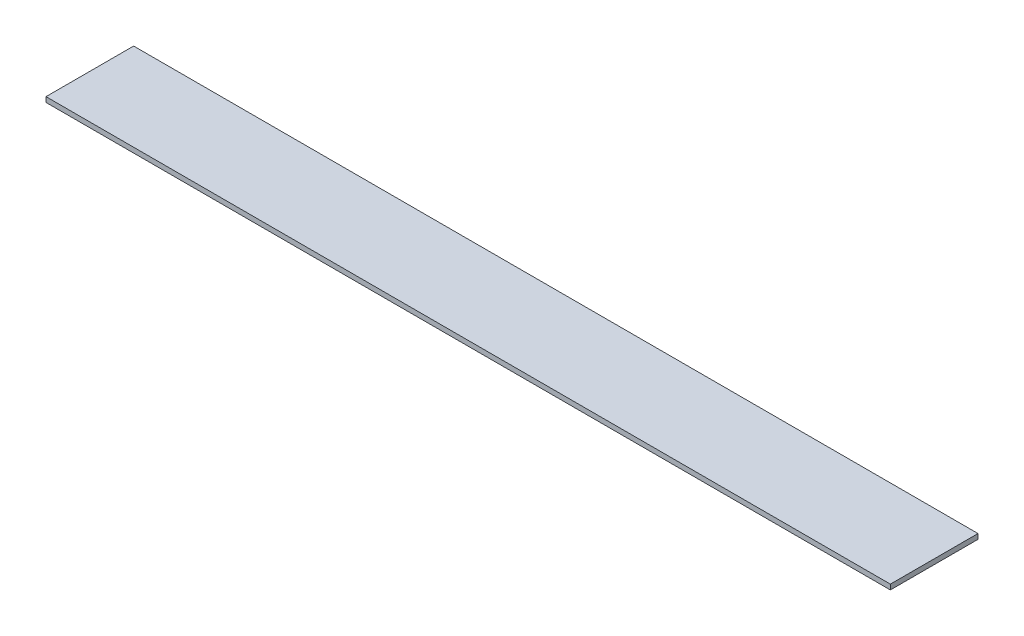
ISO-10303-21;
HEADER;
FILE_DESCRIPTION(('STEP AP214'),'2;1');
FILE_NAME('part.step','',(''),(''),'','','');
FILE_SCHEMA(('AUTOMOTIVE_DESIGN { 1 0 10303 214 1 1 1 1 }'));
ENDSEC;
DATA;
#1=APPLICATION_CONTEXT('core data for automotive mechanical design processes');
#2=APPLICATION_PROTOCOL_DEFINITION('international standard','automotive_design',2000,#1);
#3=PRODUCT_CONTEXT('',#1,'mechanical');
#4=PRODUCT('Part','Part','',(#3));
#5=PRODUCT_RELATED_PRODUCT_CATEGORY('part','',(#4));
#6=PRODUCT_DEFINITION_FORMATION('','',#4);
#7=PRODUCT_DEFINITION_CONTEXT('part definition',#1,'design');
#8=PRODUCT_DEFINITION('design','',#6,#7);
#9=PRODUCT_DEFINITION_SHAPE('','',#8);
#10=(LENGTH_UNIT() NAMED_UNIT(*) SI_UNIT(.MILLI.,.METRE.));
#11=(NAMED_UNIT(*) PLANE_ANGLE_UNIT() SI_UNIT($,.RADIAN.));
#12=(NAMED_UNIT(*) SI_UNIT($,.STERADIAN.) SOLID_ANGLE_UNIT());
#13=UNCERTAINTY_MEASURE_WITH_UNIT(LENGTH_MEASURE(1.E-05),#10,'distance_accuracy_value','');
#14=(GEOMETRIC_REPRESENTATION_CONTEXT(3) GLOBAL_UNCERTAINTY_ASSIGNED_CONTEXT((#13)) GLOBAL_UNIT_ASSIGNED_CONTEXT((#10,
#11,#12)) REPRESENTATION_CONTEXT('',''));
#15=CARTESIAN_POINT('',(0.,0.,0.));
#16=DIRECTION('',(0.,0.,1.));
#17=DIRECTION('',(1.,0.,0.));
#18=AXIS2_PLACEMENT_3D('',#15,#16,#17);
#19=CARTESIAN_POINT('',(132.36428433407,33.3550594637958,0.));
#20=DIRECTION('',(0.,1.,0.));
#21=DIRECTION('',(0.,0.,1.));
#22=AXIS2_PLACEMENT_3D('',#19,#20,#21);
#23=PLANE('',#22);
#24=DIRECTION('',(0.,0.,-1.));
#25=VECTOR('',#24,1.);
#26=CARTESIAN_POINT('',(32.3642843340703,33.3550594637958,0.));
#27=LINE('',#26,#25);
#28=CARTESIAN_POINT('',(32.3642843340703,33.3550594637958,13.3658664827248));
#29=VERTEX_POINT('',#28);
#30=CARTESIAN_POINT('',(32.3642843340703,33.3550594637958,2.98586648272482));
#31=VERTEX_POINT('',#30);
#32=EDGE_CURVE('E98',#29,#31,#27,.T.);
#33=ORIENTED_EDGE('',*,*,#32,.T.);
#34=DIRECTION('',(-1.,0.,0.));
#35=VECTOR('',#34,1.);
#36=CARTESIAN_POINT('',(132.36428433407,33.3550594637958,2.98586648272482));
#37=LINE('',#36,#35);
#38=CARTESIAN_POINT('',(132.36428433407,33.3550594637958,2.98586648272482));
#39=VERTEX_POINT('',#38);
#40=EDGE_CURVE('E11',#39,#31,#37,.T.);
#41=ORIENTED_EDGE('',*,*,#40,.F.);
#42=DIRECTION('',(0.,0.,-1.));
#43=VECTOR('',#42,1.);
#44=CARTESIAN_POINT('',(132.36428433407,33.3550594637958,0.));
#45=LINE('',#44,#43);
#46=CARTESIAN_POINT('',(132.36428433407,33.3550594637958,13.3658664827248));
#47=VERTEX_POINT('',#46);
#48=EDGE_CURVE('E75',#47,#39,#45,.T.);
#49=ORIENTED_EDGE('',*,*,#48,.F.);
#50=DIRECTION('',(-1.,0.,0.));
#51=VECTOR('',#50,1.);
#52=CARTESIAN_POINT('',(132.36428433407,33.3550594637958,13.3658664827248));
#53=LINE('',#52,#51);
#54=EDGE_CURVE('E51',#47,#29,#53,.T.);
#55=ORIENTED_EDGE('',*,*,#54,.T.);
#56=EDGE_LOOP('',(#33,#41,#49,#55));
#57=FACE_BOUND('',#56,.T.);
#58=ADVANCED_FACE('F35',(#57),#23,.F.);
#59=CARTESIAN_POINT('',(132.36428433407,0.,2.98586648272482));
#60=DIRECTION('',(0.,0.,-1.));
#61=DIRECTION('',(-1.,0.,0.));
#62=AXIS2_PLACEMENT_3D('',#59,#60,#61);
#63=PLANE('',#62);
#64=DIRECTION('',(0.,-1.,0.));
#65=VECTOR('',#64,1.);
#66=CARTESIAN_POINT('',(32.3642843340703,0.,2.98586648272482));
#67=LINE('',#66,#65);
#68=CARTESIAN_POINT('',(32.3642843340703,33.9550594637958,2.98586648272482));
#69=VERTEX_POINT('',#68);
#70=EDGE_CURVE('E84',#69,#31,#67,.T.);
#71=ORIENTED_EDGE('',*,*,#70,.F.);
#72=DIRECTION('',(-1.,0.,0.));
#73=VECTOR('',#72,1.);
#74=CARTESIAN_POINT('',(132.36428433407,33.9550594637958,2.98586648272482));
#75=LINE('',#74,#73);
#76=CARTESIAN_POINT('',(132.36428433407,33.9550594637958,2.98586648272482));
#77=VERTEX_POINT('',#76);
#78=EDGE_CURVE('E43',#77,#69,#75,.T.);
#79=ORIENTED_EDGE('',*,*,#78,.F.);
#80=DIRECTION('',(0.,-1.,0.));
#81=VECTOR('',#80,1.);
#82=CARTESIAN_POINT('',(132.36428433407,0.,2.98586648272482));
#83=LINE('',#82,#81);
#84=EDGE_CURVE('E82',#77,#39,#83,.T.);
#85=ORIENTED_EDGE('',*,*,#84,.T.);
#86=ORIENTED_EDGE('',*,*,#40,.T.);
#87=EDGE_LOOP('',(#71,#79,#85,#86));
#88=FACE_BOUND('',#87,.T.);
#89=ADVANCED_FACE('F81',(#88),#63,.T.);
#90=CARTESIAN_POINT('',(132.36428433407,33.9550594637958,0.));
#91=DIRECTION('',(0.,1.,0.));
#92=DIRECTION('',(0.,0.,1.));
#93=AXIS2_PLACEMENT_3D('',#90,#91,#92);
#94=PLANE('',#93);
#95=DIRECTION('',(0.,0.,-1.));
#96=VECTOR('',#95,1.);
#97=CARTESIAN_POINT('',(32.3642843340703,33.9550594637958,0.));
#98=LINE('',#97,#96);
#99=CARTESIAN_POINT('',(32.3642843340703,33.9550594637958,13.3658664827248));
#100=VERTEX_POINT('',#99);
#101=EDGE_CURVE('E101',#100,#69,#98,.T.);
#102=ORIENTED_EDGE('',*,*,#101,.F.);
#103=DIRECTION('',(-1.,0.,0.));
#104=VECTOR('',#103,1.);
#105=CARTESIAN_POINT('',(132.36428433407,33.9550594637958,13.3658664827248));
#106=LINE('',#105,#104);
#107=CARTESIAN_POINT('',(132.36428433407,33.9550594637958,13.3658664827248));
#108=VERTEX_POINT('',#107);
#109=EDGE_CURVE('E64',#108,#100,#106,.T.);
#110=ORIENTED_EDGE('',*,*,#109,.F.);
#111=DIRECTION('',(0.,0.,-1.));
#112=VECTOR('',#111,1.);
#113=CARTESIAN_POINT('',(132.36428433407,33.9550594637958,0.));
#114=LINE('',#113,#112);
#115=EDGE_CURVE('E90',#108,#77,#114,.T.);
#116=ORIENTED_EDGE('',*,*,#115,.T.);
#117=ORIENTED_EDGE('',*,*,#78,.T.);
#118=EDGE_LOOP('',(#102,#110,#116,#117));
#119=FACE_BOUND('',#118,.T.);
#120=ADVANCED_FACE('F92',(#119),#94,.T.);
#121=CARTESIAN_POINT('',(132.36428433407,0.,13.3658664827248));
#122=DIRECTION('',(0.,0.,1.));
#123=DIRECTION('',(1.,0.,0.));
#124=AXIS2_PLACEMENT_3D('',#121,#122,#123);
#125=PLANE('',#124);
#126=DIRECTION('',(0.,1.,0.));
#127=VECTOR('',#126,1.);
#128=CARTESIAN_POINT('',(32.3642843340703,0.,13.3658664827248));
#129=LINE('',#128,#127);
#130=EDGE_CURVE('E103',#29,#100,#129,.T.);
#131=ORIENTED_EDGE('',*,*,#130,.F.);
#132=ORIENTED_EDGE('',*,*,#54,.F.);
#133=DIRECTION('',(0.,1.,0.));
#134=VECTOR('',#133,1.);
#135=CARTESIAN_POINT('',(132.36428433407,0.,13.3658664827248));
#136=LINE('',#135,#134);
#137=EDGE_CURVE('E93',#47,#108,#136,.T.);
#138=ORIENTED_EDGE('',*,*,#137,.T.);
#139=ORIENTED_EDGE('',*,*,#109,.T.);
#140=EDGE_LOOP('',(#131,#132,#138,#139));
#141=FACE_BOUND('',#140,.T.);
#142=ADVANCED_FACE('F109',(#141),#125,.T.);
#143=CARTESIAN_POINT('',(132.36428433407,0.,0.));
#144=DIRECTION('',(1.,0.,0.));
#145=DIRECTION('',(0.,0.,-1.));
#146=AXIS2_PLACEMENT_3D('',#143,#144,#145);
#147=PLANE('',#146);
#148=ORIENTED_EDGE('',*,*,#48,.T.);
#149=ORIENTED_EDGE('',*,*,#84,.F.);
#150=ORIENTED_EDGE('',*,*,#115,.F.);
#151=ORIENTED_EDGE('',*,*,#137,.F.);
#152=EDGE_LOOP('',(#148,#149,#150,#151));
#153=FACE_BOUND('',#152,.T.);
#154=ADVANCED_FACE('F89',(#153),#147,.T.);
#155=CARTESIAN_POINT('',(32.3642843340703,0.,0.));
#156=DIRECTION('',(1.,0.,0.));
#157=DIRECTION('',(0.,0.,-1.));
#158=AXIS2_PLACEMENT_3D('',#155,#156,#157);
#159=PLANE('',#158);
#160=ORIENTED_EDGE('',*,*,#32,.F.);
#161=ORIENTED_EDGE('',*,*,#130,.T.);
#162=ORIENTED_EDGE('',*,*,#101,.T.);
#163=ORIENTED_EDGE('',*,*,#70,.T.);
#164=EDGE_LOOP('',(#160,#161,#162,#163));
#165=FACE_BOUND('',#164,.T.);
#166=ADVANCED_FACE('F108',(#165),#159,.F.);
#167=CLOSED_SHELL('',(#58,#89,#120,#142,#154,#166));
#168=MANIFOLD_SOLID_BREP('B2',#167);
#169=ADVANCED_BREP_SHAPE_REPRESENTATION('',(#18,#168),#14);
#170=SHAPE_DEFINITION_REPRESENTATION(#9,#169);
ENDSEC;
END-ISO-10303-21;
